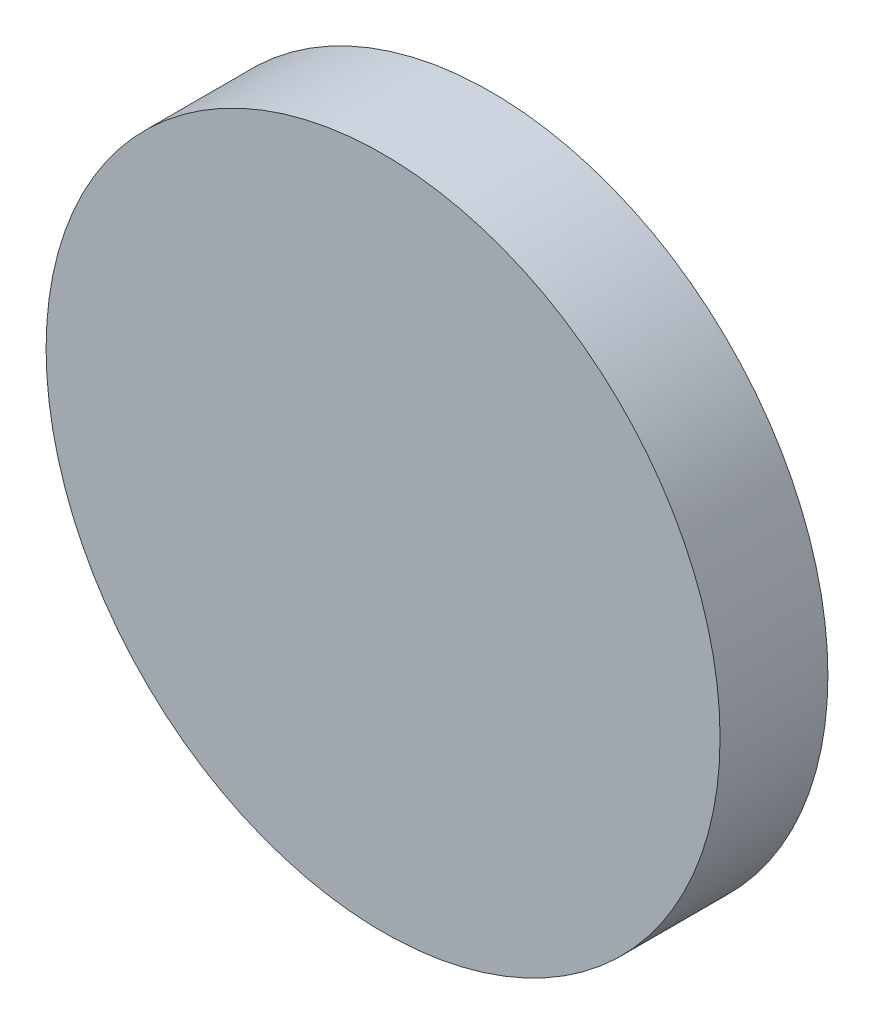
ISO-10303-21;
HEADER;
FILE_DESCRIPTION(('STEP AP214'),'2;1');
FILE_NAME('part.step','',(''),(''),'','','');
FILE_SCHEMA(('AUTOMOTIVE_DESIGN { 1 0 10303 214 1 1 1 1 }'));
ENDSEC;
DATA;
#1=APPLICATION_CONTEXT('core data for automotive mechanical design processes');
#2=APPLICATION_PROTOCOL_DEFINITION('international standard','automotive_design',2000,#1);
#3=PRODUCT_CONTEXT('',#1,'mechanical');
#4=PRODUCT('Part','Part','',(#3));
#5=PRODUCT_RELATED_PRODUCT_CATEGORY('part','',(#4));
#6=PRODUCT_DEFINITION_FORMATION('','',#4);
#7=PRODUCT_DEFINITION_CONTEXT('part definition',#1,'design');
#8=PRODUCT_DEFINITION('design','',#6,#7);
#9=PRODUCT_DEFINITION_SHAPE('','',#8);
#10=(LENGTH_UNIT() NAMED_UNIT(*) SI_UNIT(.MILLI.,.METRE.));
#11=(NAMED_UNIT(*) PLANE_ANGLE_UNIT() SI_UNIT($,.RADIAN.));
#12=(NAMED_UNIT(*) SI_UNIT($,.STERADIAN.) SOLID_ANGLE_UNIT());
#13=UNCERTAINTY_MEASURE_WITH_UNIT(LENGTH_MEASURE(1.E-05),#10,'distance_accuracy_value','');
#14=(GEOMETRIC_REPRESENTATION_CONTEXT(3) GLOBAL_UNCERTAINTY_ASSIGNED_CONTEXT((#13)) GLOBAL_UNIT_ASSIGNED_CONTEXT((#10,
#11,#12)) REPRESENTATION_CONTEXT('',''));
#15=CARTESIAN_POINT('',(0.,0.,0.));
#16=DIRECTION('',(0.,0.,1.));
#17=DIRECTION('',(1.,0.,0.));
#18=AXIS2_PLACEMENT_3D('',#15,#16,#17);
#19=CARTESIAN_POINT('',(0.,0.,8.));
#20=DIRECTION('',(0.,0.,-1.));
#21=DIRECTION('',(-1.,0.,0.));
#22=AXIS2_PLACEMENT_3D('',#19,#20,#21);
#23=CYLINDRICAL_SURFACE('',#22,25.);
#24=CARTESIAN_POINT('',(0.,0.,8.));
#25=DIRECTION('',(0.,0.,-1.));
#26=DIRECTION('',(1.,0.,0.));
#27=AXIS2_PLACEMENT_3D('',#24,#25,#26);
#28=CIRCLE('',#27,25.);
#29=CARTESIAN_POINT('',(25.,0.,8.));
#30=VERTEX_POINT('',#29);
#31=EDGE_CURVE('E10',#30,#30,#28,.T.);
#32=ORIENTED_EDGE('',*,*,#31,.T.);
#33=EDGE_LOOP('',(#32));
#34=FACE_BOUND('',#33,.T.);
#35=CARTESIAN_POINT('',(0.,0.,0.));
#36=DIRECTION('',(0.,0.,-1.));
#37=DIRECTION('',(1.,0.,0.));
#38=AXIS2_PLACEMENT_3D('',#35,#36,#37);
#39=CIRCLE('',#38,25.);
#40=CARTESIAN_POINT('',(25.,0.,0.));
#41=VERTEX_POINT('',#40);
#42=EDGE_CURVE('E18',#41,#41,#39,.T.);
#43=ORIENTED_EDGE('',*,*,#42,.F.);
#44=EDGE_LOOP('',(#43));
#45=FACE_BOUND('',#44,.T.);
#46=ADVANCED_FACE('F15',(#34,#45),#23,.T.);
#47=CARTESIAN_POINT('',(0.,0.,8.));
#48=DIRECTION('',(0.,0.,-1.));
#49=DIRECTION('',(-1.,0.,0.));
#50=AXIS2_PLACEMENT_3D('',#47,#48,#49);
#51=PLANE('',#50);
#52=ORIENTED_EDGE('',*,*,#31,.F.);
#53=EDGE_LOOP('',(#52));
#54=FACE_BOUND('',#53,.T.);
#55=ADVANCED_FACE('F33',(#54),#51,.F.);
#56=CARTESIAN_POINT('',(0.,0.,0.));
#57=DIRECTION('',(0.,0.,-1.));
#58=DIRECTION('',(-1.,0.,0.));
#59=AXIS2_PLACEMENT_3D('',#56,#57,#58);
#60=PLANE('',#59);
#61=ORIENTED_EDGE('',*,*,#42,.T.);
#62=EDGE_LOOP('',(#61));
#63=FACE_BOUND('',#62,.T.);
#64=ADVANCED_FACE('F30',(#63),#60,.T.);
#65=CLOSED_SHELL('',(#46,#55,#64));
#66=MANIFOLD_SOLID_BREP('B1',#65);
#67=ADVANCED_BREP_SHAPE_REPRESENTATION('',(#18,#66),#14);
#68=SHAPE_DEFINITION_REPRESENTATION(#9,#67);
ENDSEC;
END-ISO-10303-21;
